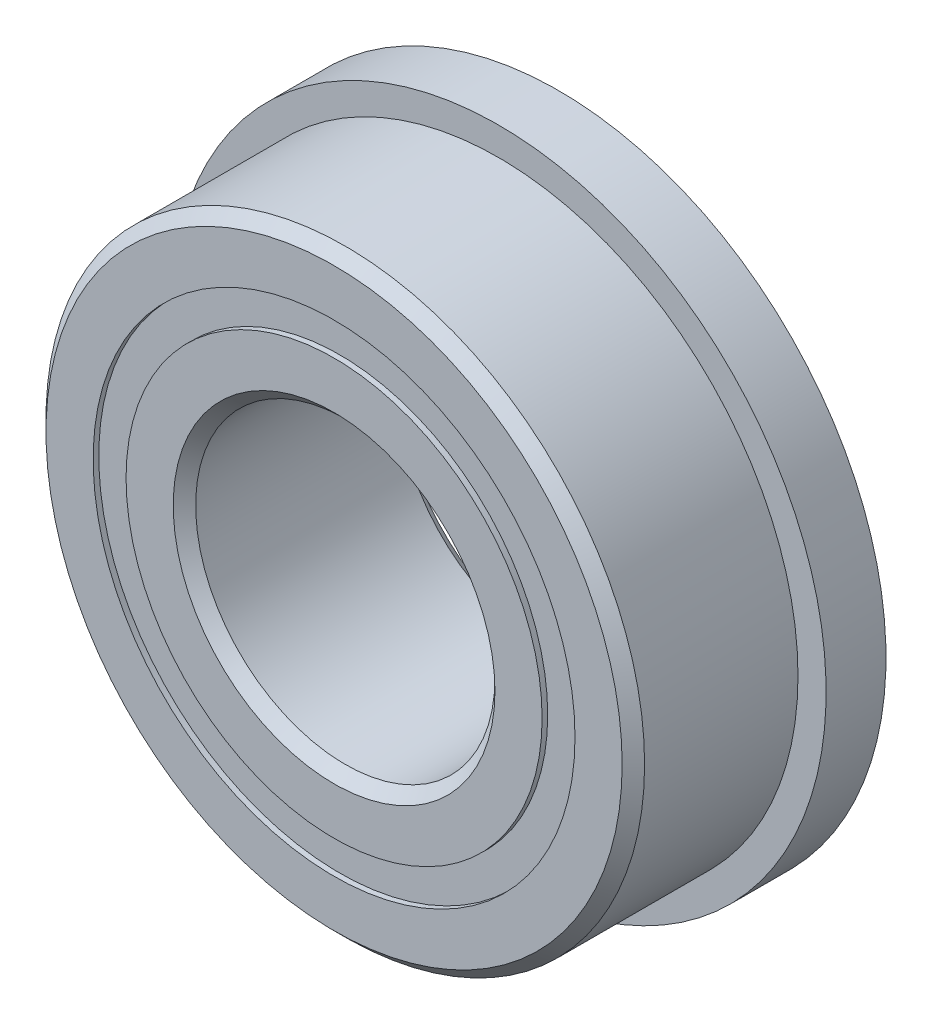
ISO-10303-21;
HEADER;
FILE_DESCRIPTION(('STEP AP214'),'2;1');
FILE_NAME('part.step','',(''),(''),'','','');
FILE_SCHEMA(('AUTOMOTIVE_DESIGN { 1 0 10303 214 1 1 1 1 }'));
ENDSEC;
DATA;
#1=APPLICATION_CONTEXT('core data for automotive mechanical design processes');
#2=APPLICATION_PROTOCOL_DEFINITION('international standard','automotive_design',2000,#1);
#3=PRODUCT_CONTEXT('',#1,'mechanical');
#4=PRODUCT('Part','Part','',(#3));
#5=PRODUCT_RELATED_PRODUCT_CATEGORY('part','',(#4));
#6=PRODUCT_DEFINITION_FORMATION('','',#4);
#7=PRODUCT_DEFINITION_CONTEXT('part definition',#1,'design');
#8=PRODUCT_DEFINITION('design','',#6,#7);
#9=PRODUCT_DEFINITION_SHAPE('','',#8);
#10=(LENGTH_UNIT() NAMED_UNIT(*) SI_UNIT(.MILLI.,.METRE.));
#11=(NAMED_UNIT(*) PLANE_ANGLE_UNIT() SI_UNIT($,.RADIAN.));
#12=(NAMED_UNIT(*) SI_UNIT($,.STERADIAN.) SOLID_ANGLE_UNIT());
#13=UNCERTAINTY_MEASURE_WITH_UNIT(LENGTH_MEASURE(1.E-05),#10,'distance_accuracy_value','');
#14=(GEOMETRIC_REPRESENTATION_CONTEXT(3) GLOBAL_UNCERTAINTY_ASSIGNED_CONTEXT((#13)) GLOBAL_UNIT_ASSIGNED_CONTEXT((#10,
#11,#12)) REPRESENTATION_CONTEXT('',''));
#15=CARTESIAN_POINT('',(0.,0.,0.));
#16=DIRECTION('',(0.,0.,1.));
#17=DIRECTION('',(1.,0.,0.));
#18=AXIS2_PLACEMENT_3D('',#15,#16,#17);
#19=CARTESIAN_POINT('',(0.,5.1114010989011,-2.2621875));
#20=DIRECTION('',(0.,0.,1.));
#21=DIRECTION('',(1.,0.,0.));
#22=AXIS2_PLACEMENT_3D('',#19,#20,#21);
#23=PLANE('',#22);
#24=CARTESIAN_POINT('',(0.,0.,-2.2621875));
#25=DIRECTION('',(0.,0.,1.));
#26=DIRECTION('',(1.,0.,0.));
#27=AXIS2_PLACEMENT_3D('',#24,#25,#26);
#28=CIRCLE('',#27,5.1114010989011);
#29=CARTESIAN_POINT('',(5.1114010989011,0.,-2.2621875));
#30=VERTEX_POINT('',#29);
#31=EDGE_CURVE('E66',#30,#30,#28,.T.);
#32=ORIENTED_EDGE('',*,*,#31,.F.);
#33=EDGE_LOOP('',(#32));
#34=FACE_BOUND('',#33,.T.);
#35=CARTESIAN_POINT('',(0.,0.,-2.2621875));
#36=DIRECTION('',(0.,0.,1.));
#37=DIRECTION('',(1.,0.,0.));
#38=AXIS2_PLACEMENT_3D('',#35,#36,#37);
#39=CIRCLE('',#38,4.4135989010989);
#40=CARTESIAN_POINT('',(4.4135989010989,0.,-2.2621875));
#41=VERTEX_POINT('',#40);
#42=EDGE_CURVE('E11',#41,#41,#39,.T.);
#43=ORIENTED_EDGE('',*,*,#42,.T.);
#44=EDGE_LOOP('',(#43));
#45=FACE_BOUND('',#44,.T.);
#46=ADVANCED_FACE('F52',(#34,#45),#23,.F.);
#47=CARTESIAN_POINT('',(0.,0.,2.38125));
#48=DIRECTION('',(0.,0.,1.));
#49=DIRECTION('',(1.,0.,0.));
#50=AXIS2_PLACEMENT_3D('',#47,#48,#49);
#51=CYLINDRICAL_SURFACE('',#50,4.4135989010989);
#52=ORIENTED_EDGE('',*,*,#42,.F.);
#53=EDGE_LOOP('',(#52));
#54=FACE_BOUND('',#53,.T.);
#55=CARTESIAN_POINT('',(0.,0.,-1.11436144103197));
#56=DIRECTION('',(0.,0.,1.));
#57=DIRECTION('',(1.,0.,0.));
#58=AXIS2_PLACEMENT_3D('',#55,#56,#57);
#59=CIRCLE('',#58,4.4135989010989);
#60=CARTESIAN_POINT('',(4.4135989010989,0.,-1.11436144103197));
#61=VERTEX_POINT('',#60);
#62=EDGE_CURVE('E58',#61,#61,#59,.T.);
#63=ORIENTED_EDGE('',*,*,#62,.T.);
#64=EDGE_LOOP('',(#63));
#65=FACE_BOUND('',#64,.T.);
#66=ADVANCED_FACE('F75',(#54,#65),#51,.F.);
#67=CARTESIAN_POINT('',(0.,5.1114010989011,-1.11436144103197));
#68=DIRECTION('',(0.,0.,-1.));
#69=DIRECTION('',(-1.,0.,0.));
#70=AXIS2_PLACEMENT_3D('',#67,#68,#69);
#71=PLANE('',#70);
#72=ORIENTED_EDGE('',*,*,#62,.F.);
#73=EDGE_LOOP('',(#72));
#74=FACE_BOUND('',#73,.T.);
#75=CARTESIAN_POINT('',(0.,0.,-1.11436144103197));
#76=DIRECTION('',(0.,0.,1.));
#77=DIRECTION('',(1.,0.,0.));
#78=AXIS2_PLACEMENT_3D('',#75,#76,#77);
#79=CIRCLE('',#78,5.1114010989011);
#80=CARTESIAN_POINT('',(5.1114010989011,0.,-1.11436144103197));
#81=VERTEX_POINT('',#80);
#82=EDGE_CURVE('E62',#81,#81,#79,.T.);
#83=ORIENTED_EDGE('',*,*,#82,.T.);
#84=EDGE_LOOP('',(#83));
#85=FACE_BOUND('',#84,.T.);
#86=ADVANCED_FACE('F79',(#74,#85),#71,.F.);
#87=CARTESIAN_POINT('',(0.,0.,2.38125));
#88=DIRECTION('',(0.,0.,1.));
#89=DIRECTION('',(1.,0.,0.));
#90=AXIS2_PLACEMENT_3D('',#87,#88,#89);
#91=CYLINDRICAL_SURFACE('',#90,5.1114010989011);
#92=ORIENTED_EDGE('',*,*,#82,.F.);
#93=EDGE_LOOP('',(#92));
#94=FACE_BOUND('',#93,.T.);
#95=ORIENTED_EDGE('',*,*,#31,.T.);
#96=EDGE_LOOP('',(#95));
#97=FACE_BOUND('',#96,.T.);
#98=ADVANCED_FACE('F72',(#94,#97),#91,.T.);
#99=CLOSED_SHELL('',(#46,#66,#86,#98));
#100=MANIFOLD_SOLID_BREP('B2',#99);
#101=CARTESIAN_POINT('',(0.,5.1114010989011,2.2621875));
#102=DIRECTION('',(0.,0.,-1.));
#103=DIRECTION('',(-1.,0.,0.));
#104=AXIS2_PLACEMENT_3D('',#101,#102,#103);
#105=PLANE('',#104);
#106=CARTESIAN_POINT('',(0.,0.,2.2621875));
#107=DIRECTION('',(0.,0.,1.));
#108=DIRECTION('',(1.,0.,0.));
#109=AXIS2_PLACEMENT_3D('',#106,#107,#108);
#110=CIRCLE('',#109,4.4135989010989);
#111=CARTESIAN_POINT('',(4.4135989010989,0.,2.2621875));
#112=VERTEX_POINT('',#111);
#113=EDGE_CURVE('E51',#112,#112,#110,.T.);
#114=ORIENTED_EDGE('',*,*,#113,.F.);
#115=EDGE_LOOP('',(#114));
#116=FACE_BOUND('',#115,.T.);
#117=CARTESIAN_POINT('',(0.,0.,2.2621875));
#118=DIRECTION('',(0.,0.,1.));
#119=DIRECTION('',(1.,0.,0.));
#120=AXIS2_PLACEMENT_3D('',#117,#118,#119);
#121=CIRCLE('',#120,5.1114010989011);
#122=CARTESIAN_POINT('',(5.1114010989011,0.,2.2621875));
#123=VERTEX_POINT('',#122);
#124=EDGE_CURVE('E126',#123,#123,#121,.T.);
#125=ORIENTED_EDGE('',*,*,#124,.T.);
#126=EDGE_LOOP('',(#125));
#127=FACE_BOUND('',#126,.T.);
#128=ADVANCED_FACE('F112',(#116,#127),#105,.F.);
#129=CARTESIAN_POINT('',(0.,0.,2.38125));
#130=DIRECTION('',(0.,0.,1.));
#131=DIRECTION('',(1.,0.,0.));
#132=AXIS2_PLACEMENT_3D('',#129,#130,#131);
#133=CYLINDRICAL_SURFACE('',#132,4.4135989010989);
#134=CARTESIAN_POINT('',(0.,0.,1.11436144103197));
#135=DIRECTION('',(0.,0.,1.));
#136=DIRECTION('',(1.,0.,0.));
#137=AXIS2_PLACEMENT_3D('',#134,#135,#136);
#138=CIRCLE('',#137,4.4135989010989);
#139=CARTESIAN_POINT('',(4.4135989010989,0.,1.11436144103197));
#140=VERTEX_POINT('',#139);
#141=EDGE_CURVE('E118',#140,#140,#138,.T.);
#142=ORIENTED_EDGE('',*,*,#141,.F.);
#143=EDGE_LOOP('',(#142));
#144=FACE_BOUND('',#143,.T.);
#145=ORIENTED_EDGE('',*,*,#113,.T.);
#146=EDGE_LOOP('',(#145));
#147=FACE_BOUND('',#146,.T.);
#148=ADVANCED_FACE('F141',(#144,#147),#133,.F.);
#149=CARTESIAN_POINT('',(0.,5.1114010989011,1.11436144103197));
#150=DIRECTION('',(0.,0.,1.));
#151=DIRECTION('',(1.,0.,0.));
#152=AXIS2_PLACEMENT_3D('',#149,#150,#151);
#153=PLANE('',#152);
#154=CARTESIAN_POINT('',(0.,0.,1.11436144103197));
#155=DIRECTION('',(0.,0.,1.));
#156=DIRECTION('',(1.,0.,0.));
#157=AXIS2_PLACEMENT_3D('',#154,#155,#156);
#158=CIRCLE('',#157,5.1114010989011);
#159=CARTESIAN_POINT('',(5.1114010989011,0.,1.11436144103197));
#160=VERTEX_POINT('',#159);
#161=EDGE_CURVE('E122',#160,#160,#158,.T.);
#162=ORIENTED_EDGE('',*,*,#161,.F.);
#163=EDGE_LOOP('',(#162));
#164=FACE_BOUND('',#163,.T.);
#165=ORIENTED_EDGE('',*,*,#141,.T.);
#166=EDGE_LOOP('',(#165));
#167=FACE_BOUND('',#166,.T.);
#168=ADVANCED_FACE('F136',(#164,#167),#153,.F.);
#169=CARTESIAN_POINT('',(0.,0.,2.38125));
#170=DIRECTION('',(0.,0.,1.));
#171=DIRECTION('',(1.,0.,0.));
#172=AXIS2_PLACEMENT_3D('',#169,#170,#171);
#173=CYLINDRICAL_SURFACE('',#172,5.1114010989011);
#174=ORIENTED_EDGE('',*,*,#124,.F.);
#175=EDGE_LOOP('',(#174));
#176=FACE_BOUND('',#175,.T.);
#177=ORIENTED_EDGE('',*,*,#161,.T.);
#178=EDGE_LOOP('',(#177));
#179=FACE_BOUND('',#178,.T.);
#180=ADVANCED_FACE('F133',(#176,#179),#173,.T.);
#181=CLOSED_SHELL('',(#128,#148,#168,#180));
#182=MANIFOLD_SOLID_BREP('B6',#181);
#183=CARTESIAN_POINT('',(-2.38124999999995,4.12444598552342,0.));
#184=DIRECTION('',(0.,0.,1.));
#185=DIRECTION('',(-0.499999999999989,0.866025403784445,0.));
#186=AXIS2_PLACEMENT_3D('',#183,#184,#185);
#187=SPHERICAL_SURFACE('',#186,1.11436144103197);
#188=CARTESIAN_POINT('',(-2.38124999999995,4.12444598552342,1.11436144103197));
#189=VERTEX_POINT('',#188);
#190=VERTEX_LOOP('',#189);
#191=FACE_BOUND('',#190,.T.);
#192=ADVANCED_FACE('F172',(#191),#187,.T.);
#193=CLOSED_SHELL('',(#192));
#194=MANIFOLD_SOLID_BREP('B46',#193);
#195=CARTESIAN_POINT('',(-4.12444598552336,2.38125000000005,0.));
#196=DIRECTION('',(0.,0.,1.));
#197=DIRECTION('',(-0.866025403784433,0.50000000000001,0.));
#198=AXIS2_PLACEMENT_3D('',#195,#196,#197);
#199=SPHERICAL_SURFACE('',#198,1.11436144103197);
#200=CARTESIAN_POINT('',(-4.12444598552336,2.38125000000005,1.11436144103197));
#201=VERTEX_POINT('',#200);
#202=VERTEX_LOOP('',#201);
#203=FACE_BOUND('',#202,.T.);
#204=ADVANCED_FACE('F195',(#203),#199,.T.);
#205=CLOSED_SHELL('',(#204));
#206=MANIFOLD_SOLID_BREP('B108',#205);
#207=CARTESIAN_POINT('',(-4.7625,0.,0.));
#208=DIRECTION('',(0.,0.,1.));
#209=DIRECTION('',(-1.,0.,0.));
#210=AXIS2_PLACEMENT_3D('',#207,#208,#209);
#211=SPHERICAL_SURFACE('',#210,1.11436144103197);
#212=CARTESIAN_POINT('',(-4.7625,0.,1.11436144103197));
#213=VERTEX_POINT('',#212);
#214=VERTEX_LOOP('',#213);
#215=FACE_BOUND('',#214,.T.);
#216=ADVANCED_FACE('F218',(#215),#211,.T.);
#217=CLOSED_SHELL('',(#216));
#218=MANIFOLD_SOLID_BREP('B168',#217);
#219=CARTESIAN_POINT('',(-4.12444598552341,-2.38124999999996,0.));
#220=DIRECTION('',(0.,0.,1.));
#221=DIRECTION('',(-0.866025403784443,-0.499999999999992,0.));
#222=AXIS2_PLACEMENT_3D('',#219,#220,#221);
#223=SPHERICAL_SURFACE('',#222,1.11436144103197);
#224=CARTESIAN_POINT('',(-4.12444598552341,-2.38124999999996,1.11436144103197));
#225=VERTEX_POINT('',#224);
#226=VERTEX_LOOP('',#225);
#227=FACE_BOUND('',#226,.T.);
#228=ADVANCED_FACE('F241',(#227),#223,.T.);
#229=CLOSED_SHELL('',(#228));
#230=MANIFOLD_SOLID_BREP('B191',#229);
#231=CARTESIAN_POINT('',(-2.38125000000003,-4.12444598552337,0.));
#232=DIRECTION('',(0.,0.,1.));
#233=DIRECTION('',(-0.500000000000007,-0.866025403784435,0.));
#234=AXIS2_PLACEMENT_3D('',#231,#232,#233);
#235=SPHERICAL_SURFACE('',#234,1.11436144103197);
#236=CARTESIAN_POINT('',(-2.38125000000003,-4.12444598552337,1.11436144103197));
#237=VERTEX_POINT('',#236);
#238=VERTEX_LOOP('',#237);
#239=FACE_BOUND('',#238,.T.);
#240=ADVANCED_FACE('F264',(#239),#235,.T.);
#241=CLOSED_SHELL('',(#240));
#242=MANIFOLD_SOLID_BREP('B214',#241);
#243=CARTESIAN_POINT('',(0.,-4.7625,0.));
#244=DIRECTION('',(0.,0.,1.));
#245=DIRECTION('',(0.,-1.,0.));
#246=AXIS2_PLACEMENT_3D('',#243,#244,#245);
#247=SPHERICAL_SURFACE('',#246,1.11436144103197);
#248=CARTESIAN_POINT('',(0.,-4.7625,1.11436144103197));
#249=VERTEX_POINT('',#248);
#250=VERTEX_LOOP('',#249);
#251=FACE_BOUND('',#250,.T.);
#252=ADVANCED_FACE('F287',(#251),#247,.T.);
#253=CLOSED_SHELL('',(#252));
#254=MANIFOLD_SOLID_BREP('B237',#253);
#255=CARTESIAN_POINT('',(2.38124999999998,-4.1244459855234,0.));
#256=DIRECTION('',(0.,0.,1.));
#257=DIRECTION('',(0.499999999999995,-0.866025403784442,0.));
#258=AXIS2_PLACEMENT_3D('',#255,#256,#257);
#259=SPHERICAL_SURFACE('',#258,1.11436144103197);
#260=CARTESIAN_POINT('',(2.38124999999998,-4.1244459855234,1.11436144103197));
#261=VERTEX_POINT('',#260);
#262=VERTEX_LOOP('',#261);
#263=FACE_BOUND('',#262,.T.);
#264=ADVANCED_FACE('F310',(#263),#259,.T.);
#265=CLOSED_SHELL('',(#264));
#266=MANIFOLD_SOLID_BREP('B260',#265);
#267=CARTESIAN_POINT('',(4.12444598552338,-2.38125000000002,0.));
#268=DIRECTION('',(0.,0.,1.));
#269=DIRECTION('',(0.866025403784436,-0.500000000000004,0.));
#270=AXIS2_PLACEMENT_3D('',#267,#268,#269);
#271=SPHERICAL_SURFACE('',#270,1.11436144103197);
#272=CARTESIAN_POINT('',(4.12444598552338,-2.38125000000002,1.11436144103197));
#273=VERTEX_POINT('',#272);
#274=VERTEX_LOOP('',#273);
#275=FACE_BOUND('',#274,.T.);
#276=ADVANCED_FACE('F333',(#275),#271,.T.);
#277=CLOSED_SHELL('',(#276));
#278=MANIFOLD_SOLID_BREP('B283',#277);
#279=CARTESIAN_POINT('',(4.7625,0.,0.));
#280=DIRECTION('',(0.,0.,1.));
#281=DIRECTION('',(1.,0.,0.));
#282=AXIS2_PLACEMENT_3D('',#279,#280,#281);
#283=SPHERICAL_SURFACE('',#282,1.11436144103197);
#284=CARTESIAN_POINT('',(4.7625,0.,1.11436144103197));
#285=VERTEX_POINT('',#284);
#286=VERTEX_LOOP('',#285);
#287=FACE_BOUND('',#286,.T.);
#288=ADVANCED_FACE('F356',(#287),#283,.T.);
#289=CLOSED_SHELL('',(#288));
#290=MANIFOLD_SOLID_BREP('B306',#289);
#291=CARTESIAN_POINT('',(4.12444598552339,2.38124999999999,0.));
#292=DIRECTION('',(0.,0.,1.));
#293=DIRECTION('',(0.86602540378444,0.499999999999998,0.));
#294=AXIS2_PLACEMENT_3D('',#291,#292,#293);
#295=SPHERICAL_SURFACE('',#294,1.11436144103197);
#296=CARTESIAN_POINT('',(4.12444598552339,2.38124999999999,1.11436144103197));
#297=VERTEX_POINT('',#296);
#298=VERTEX_LOOP('',#297);
#299=FACE_BOUND('',#298,.T.);
#300=ADVANCED_FACE('F379',(#299),#295,.T.);
#301=CLOSED_SHELL('',(#300));
#302=MANIFOLD_SOLID_BREP('B329',#301);
#303=CARTESIAN_POINT('',(2.38125,4.12444598552339,0.));
#304=DIRECTION('',(0.,0.,1.));
#305=DIRECTION('',(0.500000000000001,0.866025403784438,0.));
#306=AXIS2_PLACEMENT_3D('',#303,#304,#305);
#307=SPHERICAL_SURFACE('',#306,1.11436144103197);
#308=CARTESIAN_POINT('',(2.38125,4.12444598552339,1.11436144103197));
#309=VERTEX_POINT('',#308);
#310=VERTEX_LOOP('',#309);
#311=FACE_BOUND('',#310,.T.);
#312=ADVANCED_FACE('F402',(#311),#307,.T.);
#313=CLOSED_SHELL('',(#312));
#314=MANIFOLD_SOLID_BREP('B352',#313);
#315=CARTESIAN_POINT('',(0.,4.7625,0.));
#316=DIRECTION('',(0.,0.,1.));
#317=DIRECTION('',(0.,1.,0.));
#318=AXIS2_PLACEMENT_3D('',#315,#316,#317);
#319=SPHERICAL_SURFACE('',#318,1.11436144103197);
#320=CARTESIAN_POINT('',(0.,4.7625,1.11436144103197));
#321=VERTEX_POINT('',#320);
#322=VERTEX_LOOP('',#321);
#323=FACE_BOUND('',#322,.T.);
#324=ADVANCED_FACE('F427',(#323),#319,.T.);
#325=CLOSED_SHELL('',(#324));
#326=MANIFOLD_SOLID_BREP('B375',#325);
#327=CARTESIAN_POINT('',(0.,4.4135989010989,2.38125));
#328=DIRECTION('',(0.,0.,-1.));
#329=DIRECTION('',(-1.,0.,0.));
#330=AXIS2_PLACEMENT_3D('',#327,#328,#329);
#331=PLANE('',#330);
#332=CARTESIAN_POINT('',(0.,0.,2.38125));
#333=DIRECTION('',(0.,0.,1.));
#334=DIRECTION('',(1.,0.,0.));
#335=AXIS2_PLACEMENT_3D('',#332,#333,#334);
#336=CIRCLE('',#335,3.413125);
#337=CARTESIAN_POINT('',(3.413125,0.,2.38125));
#338=VERTEX_POINT('',#337);
#339=EDGE_CURVE('E473',#338,#338,#336,.T.);
#340=ORIENTED_EDGE('',*,*,#339,.F.);
#341=EDGE_LOOP('',(#340));
#342=FACE_BOUND('',#341,.T.);
#343=CARTESIAN_POINT('',(0.,0.,2.38125));
#344=DIRECTION('',(0.,0.,1.));
#345=DIRECTION('',(1.,0.,0.));
#346=AXIS2_PLACEMENT_3D('',#343,#344,#345);
#347=CIRCLE('',#346,4.4135989010989);
#348=CARTESIAN_POINT('',(4.4135989010989,0.,2.38125));
#349=VERTEX_POINT('',#348);
#350=EDGE_CURVE('E426',#349,#349,#347,.T.);
#351=ORIENTED_EDGE('',*,*,#350,.T.);
#352=EDGE_LOOP('',(#351));
#353=FACE_BOUND('',#352,.T.);
#354=ADVANCED_FACE('F445',(#342,#353),#331,.F.);
#355=CARTESIAN_POINT('',(0.,0.,2.38125));
#356=DIRECTION('',(0.,0.,1.));
#357=DIRECTION('',(1.,0.,0.));
#358=AXIS2_PLACEMENT_3D('',#355,#356,#357);
#359=CYLINDRICAL_SURFACE('',#358,4.4135989010989);
#360=ORIENTED_EDGE('',*,*,#350,.F.);
#361=EDGE_LOOP('',(#360));
#362=FACE_BOUND('',#361,.T.);
#363=CARTESIAN_POINT('',(0.,0.,1.05833333333333));
#364=DIRECTION('',(0.,0.,1.));
#365=DIRECTION('',(1.,0.,0.));
#366=AXIS2_PLACEMENT_3D('',#363,#364,#365);
#367=CIRCLE('',#366,4.4135989010989);
#368=CARTESIAN_POINT('',(4.4135989010989,0.,1.05833333333333));
#369=VERTEX_POINT('',#368);
#370=EDGE_CURVE('E451',#369,#369,#367,.T.);
#371=ORIENTED_EDGE('',*,*,#370,.T.);
#372=EDGE_LOOP('',(#371));
#373=FACE_BOUND('',#372,.T.);
#374=ADVANCED_FACE('F480',(#362,#373),#359,.T.);
#375=CARTESIAN_POINT('',(0.,0.,0.));
#376=DIRECTION('',(0.,0.,1.));
#377=DIRECTION('',(1.,0.,0.));
#378=AXIS2_PLACEMENT_3D('',#375,#376,#377);
#379=TOROIDAL_SURFACE('',#378,4.76249999999999,1.11436144103196);
#380=ORIENTED_EDGE('',*,*,#370,.F.);
#381=EDGE_LOOP('',(#380));
#382=FACE_BOUND('',#381,.T.);
#383=CARTESIAN_POINT('',(0.,0.,-1.05833333333333));
#384=DIRECTION('',(0.,0.,1.));
#385=DIRECTION('',(1.,0.,0.));
#386=AXIS2_PLACEMENT_3D('',#383,#384,#385);
#387=CIRCLE('',#386,4.4135989010989);
#388=CARTESIAN_POINT('',(4.4135989010989,0.,-1.05833333333333));
#389=VERTEX_POINT('',#388);
#390=EDGE_CURVE('E455',#389,#389,#387,.T.);
#391=ORIENTED_EDGE('',*,*,#390,.T.);
#392=EDGE_LOOP('',(#391));
#393=FACE_BOUND('',#392,.T.);
#394=ADVANCED_FACE('F484',(#382,#393),#379,.F.);
#395=CARTESIAN_POINT('',(0.,0.,2.38125));
#396=DIRECTION('',(0.,0.,1.));
#397=DIRECTION('',(1.,0.,0.));
#398=AXIS2_PLACEMENT_3D('',#395,#396,#397);
#399=CYLINDRICAL_SURFACE('',#398,4.4135989010989);
#400=ORIENTED_EDGE('',*,*,#390,.F.);
#401=EDGE_LOOP('',(#400));
#402=FACE_BOUND('',#401,.T.);
#403=CARTESIAN_POINT('',(0.,0.,-2.38125));
#404=DIRECTION('',(0.,0.,1.));
#405=DIRECTION('',(1.,0.,0.));
#406=AXIS2_PLACEMENT_3D('',#403,#404,#405);
#407=CIRCLE('',#406,4.4135989010989);
#408=CARTESIAN_POINT('',(4.4135989010989,0.,-2.38125));
#409=VERTEX_POINT('',#408);
#410=EDGE_CURVE('E459',#409,#409,#407,.T.);
#411=ORIENTED_EDGE('',*,*,#410,.T.);
#412=EDGE_LOOP('',(#411));
#413=FACE_BOUND('',#412,.T.);
#414=ADVANCED_FACE('F489',(#402,#413),#399,.T.);
#415=CARTESIAN_POINT('',(0.,3.413125,-2.38125));
#416=DIRECTION('',(0.,0.,1.));
#417=DIRECTION('',(1.,0.,0.));
#418=AXIS2_PLACEMENT_3D('',#415,#416,#417);
#419=PLANE('',#418);
#420=ORIENTED_EDGE('',*,*,#410,.F.);
#421=EDGE_LOOP('',(#420));
#422=FACE_BOUND('',#421,.T.);
#423=CARTESIAN_POINT('',(0.,0.,-2.38125));
#424=DIRECTION('',(0.,0.,1.));
#425=DIRECTION('',(1.,0.,0.));
#426=AXIS2_PLACEMENT_3D('',#423,#424,#425);
#427=CIRCLE('',#426,3.413125);
#428=CARTESIAN_POINT('',(3.413125,0.,-2.38125));
#429=VERTEX_POINT('',#428);
#430=EDGE_CURVE('E464',#429,#429,#427,.T.);
#431=ORIENTED_EDGE('',*,*,#430,.T.);
#432=EDGE_LOOP('',(#431));
#433=FACE_BOUND('',#432,.T.);
#434=ADVANCED_FACE('F495',(#422,#433),#419,.F.);
#435=CARTESIAN_POINT('',(0.,0.,-2.143125));
#436=DIRECTION('',(0.,0.,-1.));
#437=DIRECTION('',(-1.,0.,0.));
#438=AXIS2_PLACEMENT_3D('',#435,#436,#437);
#439=CONICAL_SURFACE('',#438,3.175,0.785398163397447);
#440=ORIENTED_EDGE('',*,*,#430,.F.);
#441=EDGE_LOOP('',(#440));
#442=FACE_BOUND('',#441,.T.);
#443=CARTESIAN_POINT('',(0.,0.,-2.143125));
#444=DIRECTION('',(0.,0.,1.));
#445=DIRECTION('',(1.,0.,0.));
#446=AXIS2_PLACEMENT_3D('',#443,#444,#445);
#447=CIRCLE('',#446,3.175);
#448=CARTESIAN_POINT('',(3.175,0.,-2.143125));
#449=VERTEX_POINT('',#448);
#450=EDGE_CURVE('E467',#449,#449,#447,.T.);
#451=ORIENTED_EDGE('',*,*,#450,.T.);
#452=EDGE_LOOP('',(#451));
#453=FACE_BOUND('',#452,.T.);
#454=ADVANCED_FACE('F499',(#442,#453),#439,.F.);
#455=CARTESIAN_POINT('',(0.,0.,2.38125));
#456=DIRECTION('',(0.,0.,1.));
#457=DIRECTION('',(1.,0.,0.));
#458=AXIS2_PLACEMENT_3D('',#455,#456,#457);
#459=CYLINDRICAL_SURFACE('',#458,3.175);
#460=ORIENTED_EDGE('',*,*,#450,.F.);
#461=EDGE_LOOP('',(#460));
#462=FACE_BOUND('',#461,.T.);
#463=CARTESIAN_POINT('',(0.,0.,2.143125));
#464=DIRECTION('',(0.,0.,1.));
#465=DIRECTION('',(1.,0.,0.));
#466=AXIS2_PLACEMENT_3D('',#463,#464,#465);
#467=CIRCLE('',#466,3.175);
#468=CARTESIAN_POINT('',(3.175,0.,2.143125));
#469=VERTEX_POINT('',#468);
#470=EDGE_CURVE('E470',#469,#469,#467,.T.);
#471=ORIENTED_EDGE('',*,*,#470,.T.);
#472=EDGE_LOOP('',(#471));
#473=FACE_BOUND('',#472,.T.);
#474=ADVANCED_FACE('F503',(#462,#473),#459,.F.);
#475=CARTESIAN_POINT('',(0.,0.,2.38125));
#476=DIRECTION('',(0.,0.,1.));
#477=DIRECTION('',(1.,0.,0.));
#478=AXIS2_PLACEMENT_3D('',#475,#476,#477);
#479=CONICAL_SURFACE('',#478,3.413125,0.785398163397448);
#480=ORIENTED_EDGE('',*,*,#470,.F.);
#481=EDGE_LOOP('',(#480));
#482=FACE_BOUND('',#481,.T.);
#483=ORIENTED_EDGE('',*,*,#339,.T.);
#484=EDGE_LOOP('',(#483));
#485=FACE_BOUND('',#484,.T.);
#486=ADVANCED_FACE('F477',(#482,#485),#479,.F.);
#487=CLOSED_SHELL('',(#354,#374,#394,#414,#434,#454,#474,#486));
#488=MANIFOLD_SOLID_BREP('B398',#487);
#489=CARTESIAN_POINT('',(0.,0.,2.143125));
#490=DIRECTION('',(0.,0.,-1.));
#491=DIRECTION('',(-1.,0.,0.));
#492=AXIS2_PLACEMENT_3D('',#489,#490,#491);
#493=CONICAL_SURFACE('',#492,6.35,0.785398163397449);
#494=CARTESIAN_POINT('',(0.,0.,2.38125));
#495=DIRECTION('',(0.,0.,1.));
#496=DIRECTION('',(1.,0.,0.));
#497=AXIS2_PLACEMENT_3D('',#494,#495,#496);
#498=CIRCLE('',#497,6.111875);
#499=CARTESIAN_POINT('',(6.111875,0.,2.38125));
#500=VERTEX_POINT('',#499);
#501=EDGE_CURVE('E573',#500,#500,#498,.T.);
#502=ORIENTED_EDGE('',*,*,#501,.F.);
#503=EDGE_LOOP('',(#502));
#504=FACE_BOUND('',#503,.T.);
#505=CARTESIAN_POINT('',(0.,0.,2.143125));
#506=DIRECTION('',(0.,0.,1.));
#507=DIRECTION('',(1.,0.,0.));
#508=AXIS2_PLACEMENT_3D('',#505,#506,#507);
#509=CIRCLE('',#508,6.35);
#510=CARTESIAN_POINT('',(6.35,0.,2.143125));
#511=VERTEX_POINT('',#510);
#512=EDGE_CURVE('E444',#511,#511,#509,.T.);
#513=ORIENTED_EDGE('',*,*,#512,.T.);
#514=EDGE_LOOP('',(#513));
#515=FACE_BOUND('',#514,.T.);
#516=ADVANCED_FACE('F551',(#504,#515),#493,.T.);
#517=CARTESIAN_POINT('',(0.,0.,2.38125));
#518=DIRECTION('',(0.,0.,1.));
#519=DIRECTION('',(1.,0.,0.));
#520=AXIS2_PLACEMENT_3D('',#517,#518,#519);
#521=CYLINDRICAL_SURFACE('',#520,6.35);
#522=CARTESIAN_POINT('',(0.,0.,-1.11125));
#523=DIRECTION('',(0.,0.,1.));
#524=DIRECTION('',(1.,0.,0.));
#525=AXIS2_PLACEMENT_3D('',#522,#523,#524);
#526=CIRCLE('',#525,6.35);
#527=CARTESIAN_POINT('',(6.35,0.,-1.11125));
#528=VERTEX_POINT('',#527);
#529=EDGE_CURVE('E576',#528,#528,#526,.T.);
#530=ORIENTED_EDGE('',*,*,#529,.T.);
#531=EDGE_LOOP('',(#530));
#532=FACE_BOUND('',#531,.T.);
#533=ORIENTED_EDGE('',*,*,#512,.F.);
#534=EDGE_LOOP('',(#533));
#535=FACE_BOUND('',#534,.T.);
#536=ADVANCED_FACE('F596',(#532,#535),#521,.T.);
#537=CARTESIAN_POINT('',(0.,6.111875,-2.38125));
#538=DIRECTION('',(0.,0.,1.));
#539=DIRECTION('',(1.,0.,0.));
#540=AXIS2_PLACEMENT_3D('',#537,#538,#539);
#541=PLANE('',#540);
#542=CARTESIAN_POINT('',(0.,0.,-2.38125));
#543=DIRECTION('',(0.,0.,1.));
#544=DIRECTION('',(1.,0.,0.));
#545=AXIS2_PLACEMENT_3D('',#542,#543,#544);
#546=CIRCLE('',#545,5.1114010989011);
#547=CARTESIAN_POINT('',(5.1114010989011,0.,-2.38125));
#548=VERTEX_POINT('',#547);
#549=EDGE_CURVE('E557',#548,#548,#546,.T.);
#550=ORIENTED_EDGE('',*,*,#549,.T.);
#551=EDGE_LOOP('',(#550));
#552=FACE_BOUND('',#551,.T.);
#553=CARTESIAN_POINT('',(0.,0.,-2.38125));
#554=DIRECTION('',(0.,0.,-1.));
#555=DIRECTION('',(-1.,0.,0.));
#556=AXIS2_PLACEMENT_3D('',#553,#554,#555);
#557=CIRCLE('',#556,6.9469);
#558=CARTESIAN_POINT('',(-6.9469,0.,-2.38125));
#559=VERTEX_POINT('',#558);
#560=EDGE_CURVE('E579',#559,#559,#557,.T.);
#561=ORIENTED_EDGE('',*,*,#560,.T.);
#562=EDGE_LOOP('',(#561));
#563=FACE_BOUND('',#562,.T.);
#564=ADVANCED_FACE('F599',(#552,#563),#541,.F.);
#565=CARTESIAN_POINT('',(0.,0.,2.38125));
#566=DIRECTION('',(0.,0.,1.));
#567=DIRECTION('',(1.,0.,0.));
#568=AXIS2_PLACEMENT_3D('',#565,#566,#567);
#569=CYLINDRICAL_SURFACE('',#568,5.1114010989011);
#570=CARTESIAN_POINT('',(0.,0.,-1.05833333333333));
#571=DIRECTION('',(0.,0.,1.));
#572=DIRECTION('',(1.,0.,0.));
#573=AXIS2_PLACEMENT_3D('',#570,#571,#572);
#574=CIRCLE('',#573,5.1114010989011);
#575=CARTESIAN_POINT('',(5.1114010989011,0.,-1.05833333333333));
#576=VERTEX_POINT('',#575);
#577=EDGE_CURVE('E561',#576,#576,#574,.T.);
#578=ORIENTED_EDGE('',*,*,#577,.T.);
#579=EDGE_LOOP('',(#578));
#580=FACE_BOUND('',#579,.T.);
#581=ORIENTED_EDGE('',*,*,#549,.F.);
#582=EDGE_LOOP('',(#581));
#583=FACE_BOUND('',#582,.T.);
#584=ADVANCED_FACE('F604',(#580,#583),#569,.F.);
#585=CARTESIAN_POINT('',(0.,0.,0.));
#586=DIRECTION('',(0.,0.,1.));
#587=DIRECTION('',(1.,0.,0.));
#588=AXIS2_PLACEMENT_3D('',#585,#586,#587);
#589=TOROIDAL_SURFACE('',#588,4.7625,1.11436144103197);
#590=ORIENTED_EDGE('',*,*,#577,.F.);
#591=EDGE_LOOP('',(#590));
#592=FACE_BOUND('',#591,.T.);
#593=CARTESIAN_POINT('',(0.,0.,1.05833333333333));
#594=DIRECTION('',(0.,0.,1.));
#595=DIRECTION('',(1.,0.,0.));
#596=AXIS2_PLACEMENT_3D('',#593,#594,#595);
#597=CIRCLE('',#596,5.1114010989011);
#598=CARTESIAN_POINT('',(5.1114010989011,0.,1.05833333333333));
#599=VERTEX_POINT('',#598);
#600=EDGE_CURVE('E565',#599,#599,#597,.T.);
#601=ORIENTED_EDGE('',*,*,#600,.T.);
#602=EDGE_LOOP('',(#601));
#603=FACE_BOUND('',#602,.T.);
#604=ADVANCED_FACE('F611',(#592,#603),#589,.F.);
#605=CARTESIAN_POINT('',(0.,0.,2.38125));
#606=DIRECTION('',(0.,0.,1.));
#607=DIRECTION('',(1.,0.,0.));
#608=AXIS2_PLACEMENT_3D('',#605,#606,#607);
#609=CYLINDRICAL_SURFACE('',#608,5.1114010989011);
#610=ORIENTED_EDGE('',*,*,#600,.F.);
#611=EDGE_LOOP('',(#610));
#612=FACE_BOUND('',#611,.T.);
#613=CARTESIAN_POINT('',(0.,0.,2.38125));
#614=DIRECTION('',(0.,0.,1.));
#615=DIRECTION('',(1.,0.,0.));
#616=AXIS2_PLACEMENT_3D('',#613,#614,#615);
#617=CIRCLE('',#616,5.1114010989011);
#618=CARTESIAN_POINT('',(5.1114010989011,0.,2.38125));
#619=VERTEX_POINT('',#618);
#620=EDGE_CURVE('E570',#619,#619,#617,.T.);
#621=ORIENTED_EDGE('',*,*,#620,.T.);
#622=EDGE_LOOP('',(#621));
#623=FACE_BOUND('',#622,.T.);
#624=ADVANCED_FACE('F615',(#612,#623),#609,.F.);
#625=CARTESIAN_POINT('',(0.,6.111875,2.38125));
#626=DIRECTION('',(0.,0.,-1.));
#627=DIRECTION('',(-1.,0.,0.));
#628=AXIS2_PLACEMENT_3D('',#625,#626,#627);
#629=PLANE('',#628);
#630=ORIENTED_EDGE('',*,*,#620,.F.);
#631=EDGE_LOOP('',(#630));
#632=FACE_BOUND('',#631,.T.);
#633=ORIENTED_EDGE('',*,*,#501,.T.);
#634=EDGE_LOOP('',(#633));
#635=FACE_BOUND('',#634,.T.);
#636=ADVANCED_FACE('F592',(#632,#635),#629,.F.);
#637=CARTESIAN_POINT('',(0.,5.1114010989011,-1.11125));
#638=DIRECTION('',(0.,0.,1.));
#639=DIRECTION('',(1.,0.,0.));
#640=AXIS2_PLACEMENT_3D('',#637,#638,#639);
#641=PLANE('',#640);
#642=CARTESIAN_POINT('',(0.,0.,-1.11125));
#643=DIRECTION('',(0.,0.,-1.));
#644=DIRECTION('',(-1.,0.,0.));
#645=AXIS2_PLACEMENT_3D('',#642,#643,#644);
#646=CIRCLE('',#645,6.9469);
#647=CARTESIAN_POINT('',(-6.9469,0.,-1.11125));
#648=VERTEX_POINT('',#647);
#649=EDGE_CURVE('E582',#648,#648,#646,.T.);
#650=ORIENTED_EDGE('',*,*,#649,.F.);
#651=EDGE_LOOP('',(#650));
#652=FACE_BOUND('',#651,.T.);
#653=ORIENTED_EDGE('',*,*,#529,.F.);
#654=EDGE_LOOP('',(#653));
#655=FACE_BOUND('',#654,.T.);
#656=ADVANCED_FACE('F589',(#652,#655),#641,.T.);
#657=CARTESIAN_POINT('',(0.,0.,-2.38125));
#658=DIRECTION('',(0.,0.,-1.));
#659=DIRECTION('',(-1.,0.,0.));
#660=AXIS2_PLACEMENT_3D('',#657,#658,#659);
#661=CYLINDRICAL_SURFACE('',#660,6.9469);
#662=ORIENTED_EDGE('',*,*,#649,.T.);
#663=EDGE_LOOP('',(#662));
#664=FACE_BOUND('',#663,.T.);
#665=ORIENTED_EDGE('',*,*,#560,.F.);
#666=EDGE_LOOP('',(#665));
#667=FACE_BOUND('',#666,.T.);
#668=ADVANCED_FACE('F586',(#664,#667),#661,.T.);
#669=CLOSED_SHELL('',(#516,#536,#564,#584,#604,#624,#636,#656,#668));
#670=MANIFOLD_SOLID_BREP('B421',#669);
#671=ADVANCED_BREP_SHAPE_REPRESENTATION('',(#18,#100,#182,#194,#206,#218,#230,#242,#254,#266,
#278,#290,#302,#314,#326,#488,#670),#14);
#672=SHAPE_DEFINITION_REPRESENTATION(#9,#671);
ENDSEC;
END-ISO-10303-21;
